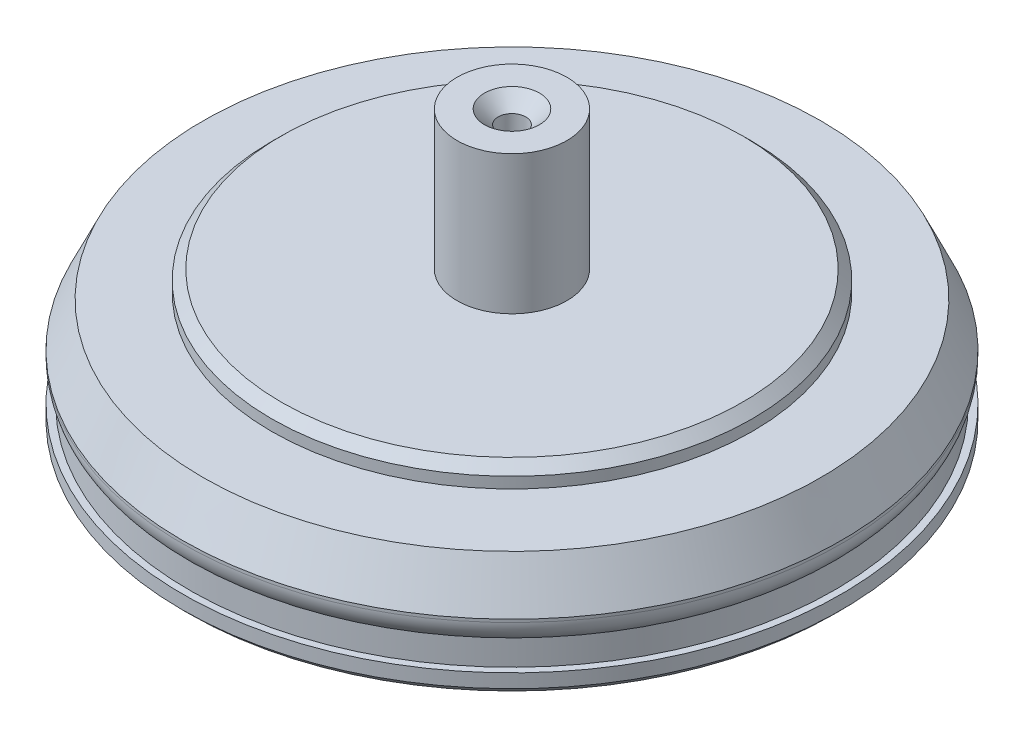
ISO-10303-21;
HEADER;
FILE_DESCRIPTION(('STEP AP214'),'2;1');
FILE_NAME('part.step','',(''),(''),'','','');
FILE_SCHEMA(('AUTOMOTIVE_DESIGN { 1 0 10303 214 1 1 1 1 }'));
ENDSEC;
DATA;
#1=APPLICATION_CONTEXT('core data for automotive mechanical design processes');
#2=APPLICATION_PROTOCOL_DEFINITION('international standard','automotive_design',2000,#1);
#3=PRODUCT_CONTEXT('',#1,'mechanical');
#4=PRODUCT('Part','Part','',(#3));
#5=PRODUCT_RELATED_PRODUCT_CATEGORY('part','',(#4));
#6=PRODUCT_DEFINITION_FORMATION('','',#4);
#7=PRODUCT_DEFINITION_CONTEXT('part definition',#1,'design');
#8=PRODUCT_DEFINITION('design','',#6,#7);
#9=PRODUCT_DEFINITION_SHAPE('','',#8);
#10=(LENGTH_UNIT() NAMED_UNIT(*) SI_UNIT(.MILLI.,.METRE.));
#11=(NAMED_UNIT(*) PLANE_ANGLE_UNIT() SI_UNIT($,.RADIAN.));
#12=(NAMED_UNIT(*) SI_UNIT($,.STERADIAN.) SOLID_ANGLE_UNIT());
#13=UNCERTAINTY_MEASURE_WITH_UNIT(LENGTH_MEASURE(1.E-05),#10,'distance_accuracy_value','');
#14=(GEOMETRIC_REPRESENTATION_CONTEXT(3) GLOBAL_UNCERTAINTY_ASSIGNED_CONTEXT((#13)) GLOBAL_UNIT_ASSIGNED_CONTEXT((#10,
#11,#12)) REPRESENTATION_CONTEXT('',''));
#15=CARTESIAN_POINT('',(0.,0.,0.));
#16=DIRECTION('',(0.,0.,1.));
#17=DIRECTION('',(1.,0.,0.));
#18=AXIS2_PLACEMENT_3D('',#15,#16,#17);
#19=CARTESIAN_POINT('',(0.,0.,0.));
#20=DIRECTION('',(0.,1.,0.));
#21=DIRECTION('',(0.,0.,1.));
#22=AXIS2_PLACEMENT_3D('',#19,#20,#21);
#23=CONICAL_SURFACE('',#22,20.7832396192357,1.13446401379631);
#24=CARTESIAN_POINT('',(0.,0.,0.));
#25=DIRECTION('',(0.,-1.,0.));
#26=DIRECTION('',(0.,0.,-1.));
#27=AXIS2_PLACEMENT_3D('',#24,#25,#26);
#28=CIRCLE('',#27,20.7832396192357);
#29=CARTESIAN_POINT('',(0.,0.,-20.7832396192357));
#30=VERTEX_POINT('',#29);
#31=EDGE_CURVE('E319',#30,#30,#28,.T.);
#32=ORIENTED_EDGE('',*,*,#31,.F.);
#33=EDGE_LOOP('',(#32));
#34=FACE_BOUND('',#33,.T.);
#35=CARTESIAN_POINT('',(0.,0.94043081021399,0.));
#36=DIRECTION('',(0.,1.,0.));
#37=DIRECTION('',(0.,0.,1.));
#38=AXIS2_PLACEMENT_3D('',#35,#36,#37);
#39=CIRCLE('',#38,22.8);
#40=CARTESIAN_POINT('',(-22.8,0.940430810213989,0.));
#41=VERTEX_POINT('',#40);
#42=CARTESIAN_POINT('',(-22.7132391164918,0.94043081021399,1.98715093464631));
#43=VERTEX_POINT('',#42);
#44=EDGE_CURVE('E58',#41,#43,#39,.F.);
#45=ORIENTED_EDGE('',*,*,#44,.T.);
#46=DIRECTION('',(0.902859012285173,-0.422618261740702,-0.0789899283371536));
#47=VECTOR('',#46,1.);
#48=CARTESIAN_POINT('',(0.,-9.69138379572007,0.));
#49=LINE('',#48,#47);
#50=CARTESIAN_POINT('',(-22.7583035013441,0.96152494754168,1.99109355744965));
#51=VERTEX_POINT('',#50);
#52=EDGE_CURVE('E124',#43,#51,#49,.F.);
#53=ORIENTED_EDGE('',*,*,#52,.T.);
#54=CARTESIAN_POINT('',(0.,0.961524947541681,0.));
#55=DIRECTION('',(0.,-1.,0.));
#56=DIRECTION('',(0.,0.,-1.));
#57=AXIS2_PLACEMENT_3D('',#54,#55,#56);
#58=CIRCLE('',#57,22.8452365234814);
#59=CARTESIAN_POINT('',(-22.8452365234814,0.961524947541681,0.));
#60=VERTEX_POINT('',#59);
#61=EDGE_CURVE('E331',#51,#60,#58,.T.);
#62=ORIENTED_EDGE('',*,*,#61,.T.);
#63=DIRECTION('',(0.906307787036649,-0.422618261740702,0.));
#64=VECTOR('',#63,1.);
#65=CARTESIAN_POINT('',(0.,-9.69138379572007,0.));
#66=LINE('',#65,#64);
#67=EDGE_CURVE('E63',#41,#60,#66,.F.);
#68=ORIENTED_EDGE('',*,*,#67,.F.);
#69=EDGE_LOOP('',(#45,#53,#62,#68));
#70=FACE_BOUND('',#69,.T.);
#71=ADVANCED_FACE('F42',(#34,#70),#23,.T.);
#72=CARTESIAN_POINT('',(0.,2.77414052161498,0.));
#73=DIRECTION('',(0.,-1.,0.));
#74=DIRECTION('',(0.,0.,-1.));
#75=AXIS2_PLACEMENT_3D('',#72,#73,#74);
#76=TOROIDAL_SURFACE('',#75,22.,2.);
#77=CARTESIAN_POINT('',(0.,2.77414052161498,0.));
#78=DIRECTION('',(0.,-1.,0.));
#79=DIRECTION('',(0.,0.,-1.));
#80=AXIS2_PLACEMENT_3D('',#77,#78,#79);
#81=CIRCLE('',#80,24.);
#82=CARTESIAN_POINT('',(0.,2.77414052161498,-24.));
#83=VERTEX_POINT('',#82);
#84=EDGE_CURVE('E328',#83,#83,#81,.F.);
#85=ORIENTED_EDGE('',*,*,#84,.F.);
#86=EDGE_LOOP('',(#85));
#87=FACE_BOUND('',#86,.T.);
#88=ORIENTED_EDGE('',*,*,#61,.F.);
#89=CARTESIAN_POINT('',(-21.9162833580184,2.77414052161498,1.91742634044819));
#90=DIRECTION('',(0.087155742747645,0.,0.996194698091747));
#91=DIRECTION('',(0.996194698091747,0.,-0.087155742747645));
#92=AXIS2_PLACEMENT_3D('',#89,#90,#91);
#93=CIRCLE('',#92,2.);
#94=CARTESIAN_POINT('',(-23.410575405156,1.45126486608267,2.04815995456966));
#95=VERTEX_POINT('',#94);
#96=EDGE_CURVE('E122',#51,#95,#93,.F.);
#97=ORIENTED_EDGE('',*,*,#96,.T.);
#98=CARTESIAN_POINT('',(0.,1.45126486608267,0.));
#99=DIRECTION('',(0.,1.,0.));
#100=DIRECTION('',(0.,0.,1.));
#101=AXIS2_PLACEMENT_3D('',#98,#99,#100);
#102=CIRCLE('',#101,23.5);
#103=CARTESIAN_POINT('',(-23.5,1.45126486608267,0.));
#104=VERTEX_POINT('',#103);
#105=EDGE_CURVE('E126',#104,#95,#102,.F.);
#106=ORIENTED_EDGE('',*,*,#105,.F.);
#107=CARTESIAN_POINT('',(-22.,2.77414052161498,0.));
#108=DIRECTION('',(0.,0.,1.));
#109=DIRECTION('',(1.,0.,0.));
#110=AXIS2_PLACEMENT_3D('',#107,#108,#109);
#111=CIRCLE('',#110,2.);
#112=EDGE_CURVE('E114',#60,#104,#111,.F.);
#113=ORIENTED_EDGE('',*,*,#112,.F.);
#114=EDGE_LOOP('',(#88,#97,#106,#113));
#115=FACE_BOUND('',#114,.T.);
#116=ADVANCED_FACE('F189',(#87,#115),#76,.T.);
#117=CARTESIAN_POINT('',(0.,-0.399999999999999,0.));
#118=DIRECTION('',(0.,-1.,0.));
#119=DIRECTION('',(0.,0.,-1.));
#120=AXIS2_PLACEMENT_3D('',#117,#118,#119);
#121=PLANE('',#120);
#122=CARTESIAN_POINT('',(0.,-0.399999999999998,0.));
#123=DIRECTION('',(0.,-1.,0.));
#124=DIRECTION('',(0.,0.,-1.));
#125=AXIS2_PLACEMENT_3D('',#122,#123,#124);
#126=CIRCLE('',#125,4.);
#127=CARTESIAN_POINT('',(0.,-0.399999999999998,-4.));
#128=VERTEX_POINT('',#127);
#129=EDGE_CURVE('E133',#128,#128,#126,.T.);
#130=ORIENTED_EDGE('',*,*,#129,.T.);
#131=EDGE_LOOP('',(#130));
#132=FACE_BOUND('',#131,.T.);
#133=CARTESIAN_POINT('',(0.,-0.400000000000001,0.));
#134=DIRECTION('',(0.,-1.,0.));
#135=DIRECTION('',(0.,0.,-1.));
#136=AXIS2_PLACEMENT_3D('',#133,#134,#135);
#137=CIRCLE('',#136,24.);
#138=CARTESIAN_POINT('',(0.,-0.400000000000001,-24.));
#139=VERTEX_POINT('',#138);
#140=EDGE_CURVE('E130',#139,#139,#137,.T.);
#141=ORIENTED_EDGE('',*,*,#140,.F.);
#142=EDGE_LOOP('',(#141));
#143=FACE_BOUND('',#142,.T.);
#144=DIRECTION('',(-0.996194698091747,0.,0.087155742747645));
#145=VECTOR('',#144,1.);
#146=CARTESIAN_POINT('',(0.,-0.399999999999998,0.));
#147=LINE('',#146,#145);
#148=CARTESIAN_POINT('',(-22.7132391164918,-0.4,1.98715093464631));
#149=VERTEX_POINT('',#148);
#150=CARTESIAN_POINT('',(-23.410575405156,-0.4,2.04815995456966));
#151=VERTEX_POINT('',#150);
#152=EDGE_CURVE('E111',#149,#151,#147,.T.);
#153=ORIENTED_EDGE('',*,*,#152,.F.);
#154=CARTESIAN_POINT('',(0.,-0.399999999999997,0.));
#155=DIRECTION('',(0.,1.,0.));
#156=DIRECTION('',(-1.,0.,0.));
#157=AXIS2_PLACEMENT_3D('',#154,#155,#156);
#158=CIRCLE('',#157,22.8);
#159=CARTESIAN_POINT('',(-22.8,-0.4,0.));
#160=VERTEX_POINT('',#159);
#161=EDGE_CURVE('E94',#149,#160,#158,.T.);
#162=ORIENTED_EDGE('',*,*,#161,.T.);
#163=DIRECTION('',(-1.,0.,0.));
#164=VECTOR('',#163,1.);
#165=CARTESIAN_POINT('',(0.,-0.399999999999998,0.));
#166=LINE('',#165,#164);
#167=CARTESIAN_POINT('',(-23.5,-0.399999999999999,0.));
#168=VERTEX_POINT('',#167);
#169=EDGE_CURVE('E101',#160,#168,#166,.T.);
#170=ORIENTED_EDGE('',*,*,#169,.T.);
#171=CARTESIAN_POINT('',(0.,-0.399999999999997,0.));
#172=DIRECTION('',(0.,1.,0.));
#173=DIRECTION('',(-1.,0.,0.));
#174=AXIS2_PLACEMENT_3D('',#171,#172,#173);
#175=CIRCLE('',#174,23.5);
#176=EDGE_CURVE('E112',#151,#168,#175,.T.);
#177=ORIENTED_EDGE('',*,*,#176,.F.);
#178=EDGE_LOOP('',(#153,#162,#170,#177));
#179=FACE_BOUND('',#178,.T.);
#180=ADVANCED_FACE('F109',(#132,#143,#179),#121,.F.);
#181=CARTESIAN_POINT('',(0.,6.2,0.));
#182=DIRECTION('',(0.,1.,0.));
#183=DIRECTION('',(0.,0.,1.));
#184=AXIS2_PLACEMENT_3D('',#181,#182,#183);
#185=PLANE('',#184);
#186=CARTESIAN_POINT('',(0.,6.2,0.));
#187=DIRECTION('',(0.,1.,0.));
#188=DIRECTION('',(0.,0.,1.));
#189=AXIS2_PLACEMENT_3D('',#186,#187,#188);
#190=CIRCLE('',#189,5.73205080756891);
#191=CARTESIAN_POINT('',(0.,6.2,5.73205080756891));
#192=VERTEX_POINT('',#191);
#193=EDGE_CURVE('E322',#192,#192,#190,.F.);
#194=ORIENTED_EDGE('',*,*,#193,.T.);
#195=EDGE_LOOP('',(#194));
#196=FACE_BOUND('',#195,.T.);
#197=CARTESIAN_POINT('',(0.,6.2,0.));
#198=DIRECTION('',(0.,1.,0.));
#199=DIRECTION('',(0.,0.,1.));
#200=AXIS2_PLACEMENT_3D('',#197,#198,#199);
#201=CIRCLE('',#200,22.5);
#202=CARTESIAN_POINT('',(0.,6.2,22.5));
#203=VERTEX_POINT('',#202);
#204=EDGE_CURVE('E316',#203,#203,#201,.T.);
#205=ORIENTED_EDGE('',*,*,#204,.T.);
#206=EDGE_LOOP('',(#205));
#207=FACE_BOUND('',#206,.T.);
#208=ADVANCED_FACE('F169',(#196,#207),#185,.T.);
#209=CARTESIAN_POINT('',(0.,0.,0.));
#210=DIRECTION('',(0.,-1.,0.));
#211=DIRECTION('',(0.,0.,-1.));
#212=AXIS2_PLACEMENT_3D('',#209,#210,#211);
#213=CYLINDRICAL_SURFACE('',#212,24.);
#214=ORIENTED_EDGE('',*,*,#84,.T.);
#215=EDGE_LOOP('',(#214));
#216=FACE_BOUND('',#215,.T.);
#217=CARTESIAN_POINT('',(0.,2.9832396192357,0.));
#218=DIRECTION('',(0.,1.,0.));
#219=DIRECTION('',(0.,0.,1.));
#220=AXIS2_PLACEMENT_3D('',#217,#218,#219);
#221=CIRCLE('',#220,24.);
#222=CARTESIAN_POINT('',(0.,2.9832396192357,24.));
#223=VERTEX_POINT('',#222);
#224=EDGE_CURVE('E313',#223,#223,#221,.F.);
#225=ORIENTED_EDGE('',*,*,#224,.T.);
#226=EDGE_LOOP('',(#225));
#227=FACE_BOUND('',#226,.T.);
#228=ADVANCED_FACE('F165',(#216,#227),#213,.T.);
#229=CARTESIAN_POINT('',(0.,0.,0.));
#230=DIRECTION('',(0.,-1.,0.));
#231=DIRECTION('',(0.,0.,-1.));
#232=AXIS2_PLACEMENT_3D('',#229,#230,#231);
#233=PLANE('',#232);
#234=CARTESIAN_POINT('',(0.,0.,0.));
#235=DIRECTION('',(0.,-1.,0.));
#236=DIRECTION('',(0.,0.,-1.));
#237=AXIS2_PLACEMENT_3D('',#234,#235,#236);
#238=CIRCLE('',#237,4.);
#239=CARTESIAN_POINT('',(0.,0.,-4.));
#240=VERTEX_POINT('',#239);
#241=EDGE_CURVE('E136',#240,#240,#238,.F.);
#242=ORIENTED_EDGE('',*,*,#241,.T.);
#243=EDGE_LOOP('',(#242));
#244=FACE_BOUND('',#243,.T.);
#245=ORIENTED_EDGE('',*,*,#31,.T.);
#246=EDGE_LOOP('',(#245));
#247=FACE_BOUND('',#246,.T.);
#248=ADVANCED_FACE('F161',(#244,#247),#233,.T.);
#249=CARTESIAN_POINT('',(0.,2.5,0.));
#250=DIRECTION('',(0.,-1.,0.));
#251=DIRECTION('',(0.,0.,-1.));
#252=AXIS2_PLACEMENT_3D('',#249,#250,#251);
#253=PLANE('',#252);
#254=CARTESIAN_POINT('',(0.,2.5,0.));
#255=DIRECTION('',(0.,-1.,0.));
#256=DIRECTION('',(0.,0.,-1.));
#257=AXIS2_PLACEMENT_3D('',#254,#255,#256);
#258=CIRCLE('',#257,20.);
#259=CARTESIAN_POINT('',(0.,2.5,-20.));
#260=VERTEX_POINT('',#259);
#261=EDGE_CURVE('E310',#260,#260,#258,.T.);
#262=ORIENTED_EDGE('',*,*,#261,.F.);
#263=EDGE_LOOP('',(#262));
#264=FACE_BOUND('',#263,.T.);
#265=ADVANCED_FACE('F157',(#264),#253,.F.);
#266=CARTESIAN_POINT('',(0.,2.85,0.));
#267=DIRECTION('',(0.,-1.,0.));
#268=DIRECTION('',(0.,0.,-1.));
#269=AXIS2_PLACEMENT_3D('',#266,#267,#268);
#270=TOROIDAL_SURFACE('',#269,20.,0.35);
#271=ORIENTED_EDGE('',*,*,#261,.T.);
#272=EDGE_LOOP('',(#271));
#273=FACE_BOUND('',#272,.T.);
#274=CARTESIAN_POINT('',(0.,3.2,0.));
#275=DIRECTION('',(0.,-1.,0.));
#276=DIRECTION('',(0.,0.,-1.));
#277=AXIS2_PLACEMENT_3D('',#274,#275,#276);
#278=CIRCLE('',#277,20.);
#279=CARTESIAN_POINT('',(0.,3.2,-20.));
#280=VERTEX_POINT('',#279);
#281=EDGE_CURVE('E302',#280,#280,#278,.T.);
#282=ORIENTED_EDGE('',*,*,#281,.F.);
#283=EDGE_LOOP('',(#282));
#284=FACE_BOUND('',#283,.T.);
#285=ADVANCED_FACE('F152',(#273,#284),#270,.F.);
#286=CARTESIAN_POINT('',(-20.,3.2,0.));
#287=CARTESIAN_POINT('',(-17.9808018759569,2.6825077674663,0.));
#288=CARTESIAN_POINT('',(-14.9123144602958,2.83531518489187,0.));
#289=CARTESIAN_POINT('',(-10.8778327817845,3.98936425394575,0.));
#290=CARTESIAN_POINT('',(-6.92296984325045,2.86061515268984,0.));
#291=CARTESIAN_POINT('',(-3.93637955317926,2.67369733012136,0.));
#292=CARTESIAN_POINT('',(-2.,3.2,0.));
#293=B_SPLINE_CURVE_WITH_KNOTS('',3,(#286,#287,#288,#289,#290,#291,#292),.UNSPECIFIED.,.F.,.F.,
(4,1,1,1,4),(0.,0.336801660052906,0.506831371986565,0.676362632656721,1.),.UNSPECIFIED.);
#294=CARTESIAN_POINT('',(0.,0.,0.));
#295=DIRECTION('',(0.,-1.,0.));
#296=AXIS1_PLACEMENT('',#294,#295);
#297=SURFACE_OF_REVOLUTION('',#293,#296);
#298=CARTESIAN_POINT('',(0.,3.2,0.));
#299=DIRECTION('',(0.,-1.,0.));
#300=DIRECTION('',(0.,0.,-1.));
#301=AXIS2_PLACEMENT_3D('',#298,#299,#300);
#302=CIRCLE('',#301,2.);
#303=CARTESIAN_POINT('',(0.,3.2,-2.));
#304=VERTEX_POINT('',#303);
#305=EDGE_CURVE('E298',#304,#304,#302,.T.);
#306=ORIENTED_EDGE('',*,*,#305,.F.);
#307=EDGE_LOOP('',(#306));
#308=FACE_BOUND('',#307,.T.);
#309=ORIENTED_EDGE('',*,*,#281,.T.);
#310=EDGE_LOOP('',(#309));
#311=FACE_BOUND('',#310,.T.);
#312=ADVANCED_FACE('F147',(#308,#311),#297,.T.);
#313=CARTESIAN_POINT('',(0.,0.,0.));
#314=DIRECTION('',(0.,-1.,0.));
#315=DIRECTION('',(0.,0.,-1.));
#316=AXIS2_PLACEMENT_3D('',#313,#314,#315);
#317=CYLINDRICAL_SURFACE('',#316,2.);
#318=CARTESIAN_POINT('',(0.,13.2,0.));
#319=DIRECTION('',(0.,1.,0.));
#320=DIRECTION('',(0.,0.,1.));
#321=AXIS2_PLACEMENT_3D('',#318,#319,#320);
#322=CIRCLE('',#321,2.);
#323=CARTESIAN_POINT('',(0.,13.2,2.));
#324=VERTEX_POINT('',#323);
#325=EDGE_CURVE('E333',#324,#324,#322,.T.);
#326=ORIENTED_EDGE('',*,*,#325,.T.);
#327=EDGE_LOOP('',(#326));
#328=FACE_BOUND('',#327,.T.);
#329=ORIENTED_EDGE('',*,*,#305,.T.);
#330=EDGE_LOOP('',(#329));
#331=FACE_BOUND('',#330,.T.);
#332=ADVANCED_FACE('F151',(#328,#331),#317,.F.);
#333=CARTESIAN_POINT('',(0.,0.,0.));
#334=DIRECTION('',(0.,-1.,0.));
#335=DIRECTION('',(0.,0.,-1.));
#336=AXIS2_PLACEMENT_3D('',#333,#334,#335);
#337=CYLINDRICAL_SURFACE('',#336,1.);
#338=CARTESIAN_POINT('',(0.,17.2,0.));
#339=DIRECTION('',(0.,-1.,0.));
#340=DIRECTION('',(0.,0.,-1.));
#341=AXIS2_PLACEMENT_3D('',#338,#339,#340);
#342=CIRCLE('',#341,1.);
#343=CARTESIAN_POINT('',(0.,17.2,-1.));
#344=VERTEX_POINT('',#343);
#345=EDGE_CURVE('E233',#344,#344,#342,.F.);
#346=ORIENTED_EDGE('',*,*,#345,.T.);
#347=EDGE_LOOP('',(#346));
#348=FACE_BOUND('',#347,.T.);
#349=CARTESIAN_POINT('',(0.,14.2,0.));
#350=DIRECTION('',(0.,-1.,0.));
#351=DIRECTION('',(0.,0.,-1.));
#352=AXIS2_PLACEMENT_3D('',#349,#350,#351);
#353=CIRCLE('',#352,1.);
#354=CARTESIAN_POINT('',(0.,14.2,-1.));
#355=VERTEX_POINT('',#354);
#356=EDGE_CURVE('E296',#355,#355,#353,.T.);
#357=ORIENTED_EDGE('',*,*,#356,.T.);
#358=EDGE_LOOP('',(#357));
#359=FACE_BOUND('',#358,.T.);
#360=ADVANCED_FACE('F284',(#348,#359),#337,.F.);
#361=CARTESIAN_POINT('',(0.,18.2,0.));
#362=DIRECTION('',(0.,-1.,0.));
#363=DIRECTION('',(0.,0.,-1.));
#364=AXIS2_PLACEMENT_3D('',#361,#362,#363);
#365=PLANE('',#364);
#366=CARTESIAN_POINT('',(0.,18.2,0.));
#367=DIRECTION('',(0.,-1.,0.));
#368=DIRECTION('',(0.,0.,-1.));
#369=AXIS2_PLACEMENT_3D('',#366,#367,#368);
#370=CIRCLE('',#369,1.99999999999997);
#371=CARTESIAN_POINT('',(0.,18.2,-1.99999999999997));
#372=VERTEX_POINT('',#371);
#373=EDGE_CURVE('E237',#372,#372,#370,.T.);
#374=ORIENTED_EDGE('',*,*,#373,.T.);
#375=EDGE_LOOP('',(#374));
#376=FACE_BOUND('',#375,.T.);
#377=CARTESIAN_POINT('',(0.,18.2,0.));
#378=DIRECTION('',(0.,-1.,0.));
#379=DIRECTION('',(0.,0.,-1.));
#380=AXIS2_PLACEMENT_3D('',#377,#378,#379);
#381=CIRCLE('',#380,4.);
#382=CARTESIAN_POINT('',(0.,18.2,-4.));
#383=VERTEX_POINT('',#382);
#384=EDGE_CURVE('E299',#383,#383,#381,.T.);
#385=ORIENTED_EDGE('',*,*,#384,.F.);
#386=EDGE_LOOP('',(#385));
#387=FACE_BOUND('',#386,.T.);
#388=ADVANCED_FACE('F272',(#376,#387),#365,.F.);
#389=CARTESIAN_POINT('',(0.,0.,0.));
#390=DIRECTION('',(0.,-1.,0.));
#391=DIRECTION('',(0.,0.,-1.));
#392=AXIS2_PLACEMENT_3D('',#389,#390,#391);
#393=CYLINDRICAL_SURFACE('',#392,4.);
#394=ORIENTED_EDGE('',*,*,#384,.T.);
#395=EDGE_LOOP('',(#394));
#396=FACE_BOUND('',#395,.T.);
#397=CARTESIAN_POINT('',(0.,8.1,0.));
#398=DIRECTION('',(0.,-1.,0.));
#399=DIRECTION('',(0.,0.,-1.));
#400=AXIS2_PLACEMENT_3D('',#397,#398,#399);
#401=CIRCLE('',#400,4.);
#402=CARTESIAN_POINT('',(0.,8.1,-4.));
#403=VERTEX_POINT('',#402);
#404=EDGE_CURVE('E305',#403,#403,#401,.T.);
#405=ORIENTED_EDGE('',*,*,#404,.F.);
#406=EDGE_LOOP('',(#405));
#407=FACE_BOUND('',#406,.T.);
#408=ADVANCED_FACE('F268',(#396,#407),#393,.T.);
#409=CARTESIAN_POINT('',(0.,8.1,0.));
#410=DIRECTION('',(0.,-1.,0.));
#411=DIRECTION('',(0.,0.,-1.));
#412=AXIS2_PLACEMENT_3D('',#409,#410,#411);
#413=PLANE('',#412);
#414=CARTESIAN_POINT('',(0.,8.1,0.));
#415=DIRECTION('',(0.,-1.,0.));
#416=DIRECTION('',(0.,0.,-1.));
#417=AXIS2_PLACEMENT_3D('',#414,#415,#416);
#418=CIRCLE('',#417,16.8);
#419=CARTESIAN_POINT('',(0.,8.1,-16.8));
#420=VERTEX_POINT('',#419);
#421=EDGE_CURVE('E228',#420,#420,#418,.F.);
#422=ORIENTED_EDGE('',*,*,#421,.T.);
#423=EDGE_LOOP('',(#422));
#424=FACE_BOUND('',#423,.T.);
#425=ORIENTED_EDGE('',*,*,#404,.T.);
#426=EDGE_LOOP('',(#425));
#427=FACE_BOUND('',#426,.T.);
#428=ADVANCED_FACE('F271',(#424,#427),#413,.F.);
#429=CARTESIAN_POINT('',(0.,0.,0.));
#430=DIRECTION('',(0.,-1.,0.));
#431=DIRECTION('',(0.,0.,-1.));
#432=AXIS2_PLACEMENT_3D('',#429,#430,#431);
#433=CYLINDRICAL_SURFACE('',#432,17.5);
#434=CARTESIAN_POINT('',(0.,7.39999999999999,0.));
#435=DIRECTION('',(0.,-1.,0.));
#436=DIRECTION('',(0.,0.,-1.));
#437=AXIS2_PLACEMENT_3D('',#434,#435,#436);
#438=CIRCLE('',#437,17.5);
#439=CARTESIAN_POINT('',(0.,7.39999999999999,-17.5));
#440=VERTEX_POINT('',#439);
#441=EDGE_CURVE('E231',#440,#440,#438,.T.);
#442=ORIENTED_EDGE('',*,*,#441,.T.);
#443=EDGE_LOOP('',(#442));
#444=FACE_BOUND('',#443,.T.);
#445=CARTESIAN_POINT('',(0.,6.6,0.));
#446=DIRECTION('',(0.,-1.,0.));
#447=DIRECTION('',(0.,0.,-1.));
#448=AXIS2_PLACEMENT_3D('',#445,#446,#447);
#449=CIRCLE('',#448,17.5);
#450=CARTESIAN_POINT('',(0.,6.6,-17.5));
#451=VERTEX_POINT('',#450);
#452=EDGE_CURVE('E141',#451,#451,#449,.T.);
#453=ORIENTED_EDGE('',*,*,#452,.F.);
#454=EDGE_LOOP('',(#453));
#455=FACE_BOUND('',#454,.T.);
#456=ADVANCED_FACE('F276',(#444,#455),#433,.T.);
#457=CARTESIAN_POINT('',(0.,6.6,0.));
#458=DIRECTION('',(0.,-1.,0.));
#459=DIRECTION('',(0.,0.,-1.));
#460=AXIS2_PLACEMENT_3D('',#457,#458,#459);
#461=PLANE('',#460);
#462=CARTESIAN_POINT('',(0.,6.6,0.));
#463=DIRECTION('',(0.,-1.,0.));
#464=DIRECTION('',(0.,0.,-1.));
#465=AXIS2_PLACEMENT_3D('',#462,#463,#464);
#466=CIRCLE('',#465,5.03923048454136);
#467=CARTESIAN_POINT('',(0.,6.6,-5.03923048454136));
#468=VERTEX_POINT('',#467);
#469=EDGE_CURVE('E325',#468,#468,#466,.F.);
#470=ORIENTED_EDGE('',*,*,#469,.T.);
#471=EDGE_LOOP('',(#470));
#472=FACE_BOUND('',#471,.T.);
#473=ORIENTED_EDGE('',*,*,#452,.T.);
#474=EDGE_LOOP('',(#473));
#475=FACE_BOUND('',#474,.T.);
#476=ADVANCED_FACE('F182',(#472,#475),#461,.T.);
#477=CARTESIAN_POINT('',(0.,2.9832396192357,0.));
#478=DIRECTION('',(0.,-1.,0.));
#479=DIRECTION('',(0.,0.,-1.));
#480=AXIS2_PLACEMENT_3D('',#477,#478,#479);
#481=CONICAL_SURFACE('',#480,24.,0.436332312998584);
#482=ORIENTED_EDGE('',*,*,#204,.F.);
#483=EDGE_LOOP('',(#482));
#484=FACE_BOUND('',#483,.T.);
#485=ORIENTED_EDGE('',*,*,#224,.F.);
#486=EDGE_LOOP('',(#485));
#487=FACE_BOUND('',#486,.T.);
#488=ADVANCED_FACE('F175',(#484,#487),#481,.T.);
#489=CARTESIAN_POINT('',(0.,6.2,0.));
#490=DIRECTION('',(0.,-1.,0.));
#491=DIRECTION('',(0.,0.,-1.));
#492=AXIS2_PLACEMENT_3D('',#489,#490,#491);
#493=CONICAL_SURFACE('',#492,5.73205080756891,1.0471975511966);
#494=ORIENTED_EDGE('',*,*,#469,.F.);
#495=EDGE_LOOP('',(#494));
#496=FACE_BOUND('',#495,.T.);
#497=ORIENTED_EDGE('',*,*,#193,.F.);
#498=EDGE_LOOP('',(#497));
#499=FACE_BOUND('',#498,.T.);
#500=ADVANCED_FACE('F181',(#496,#499),#493,.T.);
#501=CARTESIAN_POINT('',(0.,14.2,0.));
#502=DIRECTION('',(0.,-1.,0.));
#503=DIRECTION('',(0.,0.,-1.));
#504=AXIS2_PLACEMENT_3D('',#501,#502,#503);
#505=CONICAL_SURFACE('',#504,1.,0.785398163397452);
#506=ORIENTED_EDGE('',*,*,#325,.F.);
#507=EDGE_LOOP('',(#506));
#508=FACE_BOUND('',#507,.T.);
#509=ORIENTED_EDGE('',*,*,#356,.F.);
#510=EDGE_LOOP('',(#509));
#511=FACE_BOUND('',#510,.T.);
#512=ADVANCED_FACE('F196',(#508,#511),#505,.F.);
#513=CARTESIAN_POINT('',(0.,18.2,0.));
#514=DIRECTION('',(0.,1.,0.));
#515=DIRECTION('',(0.,0.,1.));
#516=AXIS2_PLACEMENT_3D('',#513,#514,#515);
#517=CONICAL_SURFACE('',#516,1.99999999999997,0.785398163397447);
#518=ORIENTED_EDGE('',*,*,#345,.F.);
#519=EDGE_LOOP('',(#518));
#520=FACE_BOUND('',#519,.T.);
#521=ORIENTED_EDGE('',*,*,#373,.F.);
#522=EDGE_LOOP('',(#521));
#523=FACE_BOUND('',#522,.T.);
#524=ADVANCED_FACE('F206',(#520,#523),#517,.F.);
#525=CARTESIAN_POINT('',(0.,7.39999999999999,0.));
#526=DIRECTION('',(0.,-1.,0.));
#527=DIRECTION('',(0.,0.,-1.));
#528=AXIS2_PLACEMENT_3D('',#525,#526,#527);
#529=CONICAL_SURFACE('',#528,17.5,0.785398163397448);
#530=ORIENTED_EDGE('',*,*,#421,.F.);
#531=EDGE_LOOP('',(#530));
#532=FACE_BOUND('',#531,.T.);
#533=ORIENTED_EDGE('',*,*,#441,.F.);
#534=EDGE_LOOP('',(#533));
#535=FACE_BOUND('',#534,.T.);
#536=ADVANCED_FACE('F212',(#532,#535),#529,.T.);
#537=CARTESIAN_POINT('',(0.,0.,0.));
#538=DIRECTION('',(0.,-1.,0.));
#539=DIRECTION('',(0.,0.,-1.));
#540=AXIS2_PLACEMENT_3D('',#537,#538,#539);
#541=CYLINDRICAL_SURFACE('',#540,4.);
#542=ORIENTED_EDGE('',*,*,#241,.F.);
#543=EDGE_LOOP('',(#542));
#544=FACE_BOUND('',#543,.T.);
#545=ORIENTED_EDGE('',*,*,#129,.F.);
#546=EDGE_LOOP('',(#545));
#547=FACE_BOUND('',#546,.T.);
#548=ADVANCED_FACE('F217',(#544,#547),#541,.T.);
#549=CARTESIAN_POINT('',(0.,0.,0.));
#550=DIRECTION('',(0.,-1.,0.));
#551=DIRECTION('',(0.,0.,-1.));
#552=AXIS2_PLACEMENT_3D('',#549,#550,#551);
#553=CYLINDRICAL_SURFACE('',#552,24.);
#554=CARTESIAN_POINT('',(0.,-1.4,0.));
#555=DIRECTION('',(0.,1.,0.));
#556=DIRECTION('',(0.,0.,1.));
#557=AXIS2_PLACEMENT_3D('',#554,#555,#556);
#558=CIRCLE('',#557,24.);
#559=CARTESIAN_POINT('',(0.,-1.4,24.));
#560=VERTEX_POINT('',#559);
#561=EDGE_CURVE('E11',#560,#560,#558,.T.);
#562=ORIENTED_EDGE('',*,*,#561,.T.);
#563=EDGE_LOOP('',(#562));
#564=FACE_BOUND('',#563,.T.);
#565=ORIENTED_EDGE('',*,*,#140,.T.);
#566=EDGE_LOOP('',(#565));
#567=FACE_BOUND('',#566,.T.);
#568=ADVANCED_FACE('F222',(#564,#567),#553,.T.);
#569=CARTESIAN_POINT('',(0.,-1.9,0.));
#570=DIRECTION('',(0.,1.,0.));
#571=DIRECTION('',(0.,0.,1.));
#572=AXIS2_PLACEMENT_3D('',#569,#570,#571);
#573=PLANE('',#572);
#574=CARTESIAN_POINT('',(0.,-1.9,0.));
#575=DIRECTION('',(0.,1.,0.));
#576=DIRECTION('',(0.,0.,1.));
#577=AXIS2_PLACEMENT_3D('',#574,#575,#576);
#578=CIRCLE('',#577,23.5);
#579=CARTESIAN_POINT('',(0.,-1.9,23.5));
#580=VERTEX_POINT('',#579);
#581=EDGE_CURVE('E51',#580,#580,#578,.F.);
#582=ORIENTED_EDGE('',*,*,#581,.T.);
#583=EDGE_LOOP('',(#582));
#584=FACE_BOUND('',#583,.T.);
#585=ADVANCED_FACE('F245',(#584),#573,.F.);
#586=CARTESIAN_POINT('',(0.,1.,0.));
#587=DIRECTION('',(0.,1.,0.));
#588=DIRECTION('',(-1.,0.,0.));
#589=AXIS2_PLACEMENT_3D('',#586,#587,#588);
#590=CYLINDRICAL_SURFACE('',#589,22.8);
#591=ORIENTED_EDGE('',*,*,#44,.F.);
#592=DIRECTION('',(0.,-1.,0.));
#593=VECTOR('',#592,1.);
#594=CARTESIAN_POINT('',(-22.8,0.,0.));
#595=LINE('',#594,#593);
#596=EDGE_CURVE('E89',#41,#160,#595,.T.);
#597=ORIENTED_EDGE('',*,*,#596,.T.);
#598=ORIENTED_EDGE('',*,*,#161,.F.);
#599=DIRECTION('',(0.,-1.,0.));
#600=VECTOR('',#599,1.);
#601=CARTESIAN_POINT('',(-22.7132391164918,0.,1.98715093464631));
#602=LINE('',#601,#600);
#603=EDGE_CURVE('E107',#43,#149,#602,.T.);
#604=ORIENTED_EDGE('',*,*,#603,.F.);
#605=EDGE_LOOP('',(#591,#597,#598,#604));
#606=FACE_BOUND('',#605,.T.);
#607=ADVANCED_FACE('F91',(#606),#590,.F.);
#608=CARTESIAN_POINT('',(0.,1.,0.));
#609=DIRECTION('',(0.,1.,0.));
#610=DIRECTION('',(-1.,0.,0.));
#611=AXIS2_PLACEMENT_3D('',#608,#609,#610);
#612=CYLINDRICAL_SURFACE('',#611,23.5);
#613=DIRECTION('',(0.,-1.,0.));
#614=VECTOR('',#613,1.);
#615=CARTESIAN_POINT('',(-23.5,0.,0.));
#616=LINE('',#615,#614);
#617=EDGE_CURVE('E97',#104,#168,#616,.T.);
#618=ORIENTED_EDGE('',*,*,#617,.F.);
#619=ORIENTED_EDGE('',*,*,#105,.T.);
#620=DIRECTION('',(0.,-1.,0.));
#621=VECTOR('',#620,1.);
#622=CARTESIAN_POINT('',(-23.410575405156,0.,2.04815995456966));
#623=LINE('',#622,#621);
#624=EDGE_CURVE('E116',#95,#151,#623,.T.);
#625=ORIENTED_EDGE('',*,*,#624,.T.);
#626=ORIENTED_EDGE('',*,*,#176,.T.);
#627=EDGE_LOOP('',(#618,#619,#625,#626));
#628=FACE_BOUND('',#627,.T.);
#629=ADVANCED_FACE('F358',(#628),#612,.T.);
#630=CARTESIAN_POINT('',(0.,0.,0.));
#631=DIRECTION('',(0.087155742747645,0.,0.996194698091747));
#632=DIRECTION('',(0.996194698091747,0.,-0.087155742747645));
#633=AXIS2_PLACEMENT_3D('',#630,#631,#632);
#634=PLANE('',#633);
#635=ORIENTED_EDGE('',*,*,#52,.F.);
#636=ORIENTED_EDGE('',*,*,#603,.T.);
#637=ORIENTED_EDGE('',*,*,#152,.T.);
#638=ORIENTED_EDGE('',*,*,#624,.F.);
#639=ORIENTED_EDGE('',*,*,#96,.F.);
#640=EDGE_LOOP('',(#635,#636,#637,#638,#639));
#641=FACE_BOUND('',#640,.T.);
#642=ADVANCED_FACE('F252',(#641),#634,.F.);
#643=CARTESIAN_POINT('',(0.,0.,0.));
#644=DIRECTION('',(0.,0.,1.));
#645=DIRECTION('',(1.,0.,0.));
#646=AXIS2_PLACEMENT_3D('',#643,#644,#645);
#647=PLANE('',#646);
#648=ORIENTED_EDGE('',*,*,#596,.F.);
#649=ORIENTED_EDGE('',*,*,#67,.T.);
#650=ORIENTED_EDGE('',*,*,#112,.T.);
#651=ORIENTED_EDGE('',*,*,#617,.T.);
#652=ORIENTED_EDGE('',*,*,#169,.F.);
#653=EDGE_LOOP('',(#648,#649,#650,#651,#652));
#654=FACE_BOUND('',#653,.T.);
#655=ADVANCED_FACE('F102',(#654),#647,.T.);
#656=CARTESIAN_POINT('',(0.,-1.9,0.));
#657=DIRECTION('',(0.,1.,0.));
#658=DIRECTION('',(0.,0.,1.));
#659=AXIS2_PLACEMENT_3D('',#656,#657,#658);
#660=CONICAL_SURFACE('',#659,23.5,0.785398163397434);
#661=ORIENTED_EDGE('',*,*,#561,.F.);
#662=EDGE_LOOP('',(#661));
#663=FACE_BOUND('',#662,.T.);
#664=ORIENTED_EDGE('',*,*,#581,.F.);
#665=EDGE_LOOP('',(#664));
#666=FACE_BOUND('',#665,.T.);
#667=ADVANCED_FACE('F45',(#663,#666),#660,.T.);
#668=CLOSED_SHELL('',(#71,#116,#180,#208,#228,#248,#265,#285,#312,#332,#360,#388,#408,#428,#456,
#476,#488,#500,#512,#524,#536,#548,#568,#585,#607,#629,#642,#655,#667));
#669=MANIFOLD_SOLID_BREP('B2',#668);
#670=ADVANCED_BREP_SHAPE_REPRESENTATION('',(#18,#669),#14);
#671=SHAPE_DEFINITION_REPRESENTATION(#9,#670);
ENDSEC;
END-ISO-10303-21;
